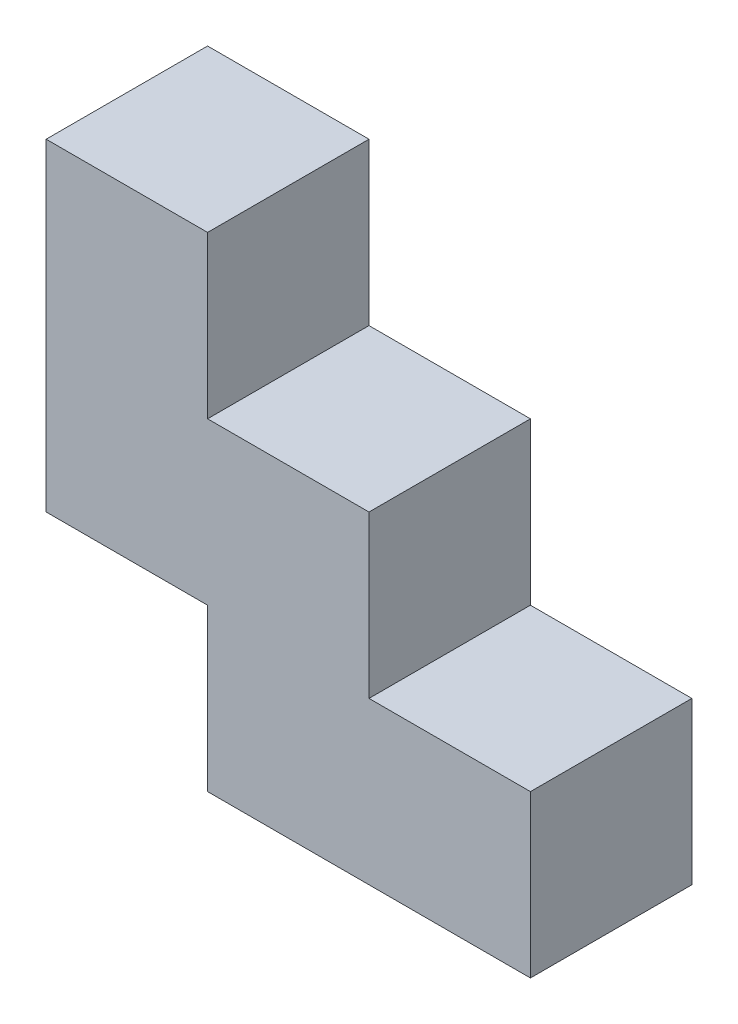
ISO-10303-21;
HEADER;
FILE_DESCRIPTION(('STEP AP214'),'2;1');
FILE_NAME('part.step','',(''),(''),'','','');
FILE_SCHEMA(('AUTOMOTIVE_DESIGN { 1 0 10303 214 1 1 1 1 }'));
ENDSEC;
DATA;
#1=APPLICATION_CONTEXT('core data for automotive mechanical design processes');
#2=APPLICATION_PROTOCOL_DEFINITION('international standard','automotive_design',2000,#1);
#3=PRODUCT_CONTEXT('',#1,'mechanical');
#4=PRODUCT('Part','Part','',(#3));
#5=PRODUCT_RELATED_PRODUCT_CATEGORY('part','',(#4));
#6=PRODUCT_DEFINITION_FORMATION('','',#4);
#7=PRODUCT_DEFINITION_CONTEXT('part definition',#1,'design');
#8=PRODUCT_DEFINITION('design','',#6,#7);
#9=PRODUCT_DEFINITION_SHAPE('','',#8);
#10=(LENGTH_UNIT() NAMED_UNIT(*) SI_UNIT(.MILLI.,.METRE.));
#11=(NAMED_UNIT(*) PLANE_ANGLE_UNIT() SI_UNIT($,.RADIAN.));
#12=(NAMED_UNIT(*) SI_UNIT($,.STERADIAN.) SOLID_ANGLE_UNIT());
#13=UNCERTAINTY_MEASURE_WITH_UNIT(LENGTH_MEASURE(1.E-05),#10,'distance_accuracy_value','');
#14=(GEOMETRIC_REPRESENTATION_CONTEXT(3) GLOBAL_UNCERTAINTY_ASSIGNED_CONTEXT((#13)) GLOBAL_UNIT_ASSIGNED_CONTEXT((#10,
#11,#12)) REPRESENTATION_CONTEXT('',''));
#15=CARTESIAN_POINT('',(0.,0.,0.));
#16=DIRECTION('',(0.,0.,1.));
#17=DIRECTION('',(1.,0.,0.));
#18=AXIS2_PLACEMENT_3D('',#15,#16,#17);
#19=CARTESIAN_POINT('',(76.2,0.,25.4));
#20=DIRECTION('',(-1.,0.,0.));
#21=DIRECTION('',(0.,0.,1.));
#22=AXIS2_PLACEMENT_3D('',#19,#20,#21);
#23=PLANE('',#22);
#24=DIRECTION('',(0.,1.,0.));
#25=VECTOR('',#24,1.);
#26=CARTESIAN_POINT('',(76.2,0.,0.));
#27=LINE('',#26,#25);
#28=CARTESIAN_POINT('',(76.2,0.,0.));
#29=VERTEX_POINT('',#28);
#30=CARTESIAN_POINT('',(76.2,25.4,0.));
#31=VERTEX_POINT('',#30);
#32=EDGE_CURVE('E145',#29,#31,#27,.T.);
#33=ORIENTED_EDGE('',*,*,#32,.T.);
#34=DIRECTION('',(0.,0.,-1.));
#35=VECTOR('',#34,1.);
#36=CARTESIAN_POINT('',(76.2,25.4,25.4));
#37=LINE('',#36,#35);
#38=CARTESIAN_POINT('',(76.2,25.4,25.4));
#39=VERTEX_POINT('',#38);
#40=EDGE_CURVE('E41',#39,#31,#37,.T.);
#41=ORIENTED_EDGE('',*,*,#40,.F.);
#42=DIRECTION('',(0.,1.,0.));
#43=VECTOR('',#42,1.);
#44=CARTESIAN_POINT('',(76.2,0.,25.4));
#45=LINE('',#44,#43);
#46=CARTESIAN_POINT('',(76.2,0.,25.4));
#47=VERTEX_POINT('',#46);
#48=EDGE_CURVE('E99',#47,#39,#45,.T.);
#49=ORIENTED_EDGE('',*,*,#48,.F.);
#50=DIRECTION('',(0.,0.,-1.));
#51=VECTOR('',#50,1.);
#52=CARTESIAN_POINT('',(76.2,0.,25.4));
#53=LINE('',#52,#51);
#54=EDGE_CURVE('E11',#47,#29,#53,.T.);
#55=ORIENTED_EDGE('',*,*,#54,.T.);
#56=EDGE_LOOP('',(#33,#41,#49,#55));
#57=FACE_BOUND('',#56,.T.);
#58=ADVANCED_FACE('F33',(#57),#23,.F.);
#59=CARTESIAN_POINT('',(76.2,25.4,25.4));
#60=DIRECTION('',(0.,-1.,0.));
#61=DIRECTION('',(0.,0.,-1.));
#62=AXIS2_PLACEMENT_3D('',#59,#60,#61);
#63=PLANE('',#62);
#64=DIRECTION('',(-1.,0.,0.));
#65=VECTOR('',#64,1.);
#66=CARTESIAN_POINT('',(76.2,25.4,0.));
#67=LINE('',#66,#65);
#68=CARTESIAN_POINT('',(50.8,25.4,0.));
#69=VERTEX_POINT('',#68);
#70=EDGE_CURVE('E147',#31,#69,#67,.T.);
#71=ORIENTED_EDGE('',*,*,#70,.T.);
#72=DIRECTION('',(0.,0.,-1.));
#73=VECTOR('',#72,1.);
#74=CARTESIAN_POINT('',(50.8,25.4,25.4));
#75=LINE('',#74,#73);
#76=CARTESIAN_POINT('',(50.8,25.4,25.4));
#77=VERTEX_POINT('',#76);
#78=EDGE_CURVE('E174',#77,#69,#75,.T.);
#79=ORIENTED_EDGE('',*,*,#78,.F.);
#80=DIRECTION('',(-1.,0.,0.));
#81=VECTOR('',#80,1.);
#82=CARTESIAN_POINT('',(76.2,25.4,25.4));
#83=LINE('',#82,#81);
#84=EDGE_CURVE('E182',#39,#77,#83,.T.);
#85=ORIENTED_EDGE('',*,*,#84,.F.);
#86=ORIENTED_EDGE('',*,*,#40,.T.);
#87=EDGE_LOOP('',(#71,#79,#85,#86));
#88=FACE_BOUND('',#87,.T.);
#89=ADVANCED_FACE('F180',(#88),#63,.F.);
#90=CARTESIAN_POINT('',(50.8,25.4,25.4));
#91=DIRECTION('',(-1.,0.,0.));
#92=DIRECTION('',(0.,0.,1.));
#93=AXIS2_PLACEMENT_3D('',#90,#91,#92);
#94=PLANE('',#93);
#95=DIRECTION('',(0.,1.,0.));
#96=VECTOR('',#95,1.);
#97=CARTESIAN_POINT('',(50.8,25.4,0.));
#98=LINE('',#97,#96);
#99=CARTESIAN_POINT('',(50.8,50.8,0.));
#100=VERTEX_POINT('',#99);
#101=EDGE_CURVE('E149',#69,#100,#98,.T.);
#102=ORIENTED_EDGE('',*,*,#101,.T.);
#103=DIRECTION('',(0.,0.,-1.));
#104=VECTOR('',#103,1.);
#105=CARTESIAN_POINT('',(50.8,50.8,25.4));
#106=LINE('',#105,#104);
#107=CARTESIAN_POINT('',(50.8,50.8,25.4));
#108=VERTEX_POINT('',#107);
#109=EDGE_CURVE('E171',#108,#100,#106,.T.);
#110=ORIENTED_EDGE('',*,*,#109,.F.);
#111=DIRECTION('',(0.,1.,0.));
#112=VECTOR('',#111,1.);
#113=CARTESIAN_POINT('',(50.8,25.4,25.4));
#114=LINE('',#113,#112);
#115=EDGE_CURVE('E201',#77,#108,#114,.T.);
#116=ORIENTED_EDGE('',*,*,#115,.F.);
#117=ORIENTED_EDGE('',*,*,#78,.T.);
#118=EDGE_LOOP('',(#102,#110,#116,#117));
#119=FACE_BOUND('',#118,.T.);
#120=ADVANCED_FACE('F192',(#119),#94,.F.);
#121=CARTESIAN_POINT('',(50.8,50.8,25.4));
#122=DIRECTION('',(0.,-1.,0.));
#123=DIRECTION('',(0.,0.,-1.));
#124=AXIS2_PLACEMENT_3D('',#121,#122,#123);
#125=PLANE('',#124);
#126=DIRECTION('',(-1.,0.,0.));
#127=VECTOR('',#126,1.);
#128=CARTESIAN_POINT('',(50.8,50.8,0.));
#129=LINE('',#128,#127);
#130=CARTESIAN_POINT('',(25.4,50.8,0.));
#131=VERTEX_POINT('',#130);
#132=EDGE_CURVE('E151',#100,#131,#129,.T.);
#133=ORIENTED_EDGE('',*,*,#132,.T.);
#134=DIRECTION('',(0.,0.,-1.));
#135=VECTOR('',#134,1.);
#136=CARTESIAN_POINT('',(25.4,50.8,25.4));
#137=LINE('',#136,#135);
#138=CARTESIAN_POINT('',(25.4,50.8,25.4));
#139=VERTEX_POINT('',#138);
#140=EDGE_CURVE('E168',#139,#131,#137,.T.);
#141=ORIENTED_EDGE('',*,*,#140,.F.);
#142=DIRECTION('',(-1.,0.,0.));
#143=VECTOR('',#142,1.);
#144=CARTESIAN_POINT('',(50.8,50.8,25.4));
#145=LINE('',#144,#143);
#146=EDGE_CURVE('E198',#108,#139,#145,.T.);
#147=ORIENTED_EDGE('',*,*,#146,.F.);
#148=ORIENTED_EDGE('',*,*,#109,.T.);
#149=EDGE_LOOP('',(#133,#141,#147,#148));
#150=FACE_BOUND('',#149,.T.);
#151=ADVANCED_FACE('F196',(#150),#125,.F.);
#152=CARTESIAN_POINT('',(25.4,50.8,25.4));
#153=DIRECTION('',(-1.,0.,0.));
#154=DIRECTION('',(0.,0.,1.));
#155=AXIS2_PLACEMENT_3D('',#152,#153,#154);
#156=PLANE('',#155);
#157=DIRECTION('',(0.,1.,0.));
#158=VECTOR('',#157,1.);
#159=CARTESIAN_POINT('',(25.4,50.8,0.));
#160=LINE('',#159,#158);
#161=CARTESIAN_POINT('',(25.4,76.2,0.));
#162=VERTEX_POINT('',#161);
#163=EDGE_CURVE('E153',#131,#162,#160,.T.);
#164=ORIENTED_EDGE('',*,*,#163,.T.);
#165=DIRECTION('',(0.,0.,-1.));
#166=VECTOR('',#165,1.);
#167=CARTESIAN_POINT('',(25.4,76.2,25.4));
#168=LINE('',#167,#166);
#169=CARTESIAN_POINT('',(25.4,76.2,25.4));
#170=VERTEX_POINT('',#169);
#171=EDGE_CURVE('E165',#170,#162,#168,.T.);
#172=ORIENTED_EDGE('',*,*,#171,.F.);
#173=DIRECTION('',(0.,1.,0.));
#174=VECTOR('',#173,1.);
#175=CARTESIAN_POINT('',(25.4,50.8,25.4));
#176=LINE('',#175,#174);
#177=EDGE_CURVE('E200',#139,#170,#176,.T.);
#178=ORIENTED_EDGE('',*,*,#177,.F.);
#179=ORIENTED_EDGE('',*,*,#140,.T.);
#180=EDGE_LOOP('',(#164,#172,#178,#179));
#181=FACE_BOUND('',#180,.T.);
#182=ADVANCED_FACE('F220',(#181),#156,.F.);
#183=CARTESIAN_POINT('',(25.4,76.2,25.4));
#184=DIRECTION('',(0.,-1.,0.));
#185=DIRECTION('',(0.,0.,-1.));
#186=AXIS2_PLACEMENT_3D('',#183,#184,#185);
#187=PLANE('',#186);
#188=DIRECTION('',(-1.,0.,0.));
#189=VECTOR('',#188,1.);
#190=CARTESIAN_POINT('',(25.4,76.2,0.));
#191=LINE('',#190,#189);
#192=CARTESIAN_POINT('',(0.,76.2,0.));
#193=VERTEX_POINT('',#192);
#194=EDGE_CURVE('E155',#162,#193,#191,.T.);
#195=ORIENTED_EDGE('',*,*,#194,.T.);
#196=DIRECTION('',(0.,0.,-1.));
#197=VECTOR('',#196,1.);
#198=CARTESIAN_POINT('',(0.,76.2,25.4));
#199=LINE('',#198,#197);
#200=CARTESIAN_POINT('',(0.,76.2,25.4));
#201=VERTEX_POINT('',#200);
#202=EDGE_CURVE('E134',#201,#193,#199,.T.);
#203=ORIENTED_EDGE('',*,*,#202,.F.);
#204=DIRECTION('',(-1.,0.,0.));
#205=VECTOR('',#204,1.);
#206=CARTESIAN_POINT('',(25.4,76.2,25.4));
#207=LINE('',#206,#205);
#208=EDGE_CURVE('E125',#170,#201,#207,.T.);
#209=ORIENTED_EDGE('',*,*,#208,.F.);
#210=ORIENTED_EDGE('',*,*,#171,.T.);
#211=EDGE_LOOP('',(#195,#203,#209,#210));
#212=FACE_BOUND('',#211,.T.);
#213=ADVANCED_FACE('F223',(#212),#187,.F.);
#214=CARTESIAN_POINT('',(0.,76.2,25.4));
#215=DIRECTION('',(1.,0.,0.));
#216=DIRECTION('',(0.,0.,-1.));
#217=AXIS2_PLACEMENT_3D('',#214,#215,#216);
#218=PLANE('',#217);
#219=DIRECTION('',(0.,-1.,0.));
#220=VECTOR('',#219,1.);
#221=CARTESIAN_POINT('',(0.,76.2,0.));
#222=LINE('',#221,#220);
#223=CARTESIAN_POINT('',(0.,25.4,0.));
#224=VERTEX_POINT('',#223);
#225=EDGE_CURVE('E133',#193,#224,#222,.T.);
#226=ORIENTED_EDGE('',*,*,#225,.T.);
#227=DIRECTION('',(0.,0.,-1.));
#228=VECTOR('',#227,1.);
#229=CARTESIAN_POINT('',(0.,25.4,25.4));
#230=LINE('',#229,#228);
#231=CARTESIAN_POINT('',(0.,25.4,25.4));
#232=VERTEX_POINT('',#231);
#233=EDGE_CURVE('E130',#232,#224,#230,.T.);
#234=ORIENTED_EDGE('',*,*,#233,.F.);
#235=DIRECTION('',(0.,-1.,0.));
#236=VECTOR('',#235,1.);
#237=CARTESIAN_POINT('',(0.,76.2,25.4));
#238=LINE('',#237,#236);
#239=EDGE_CURVE('E119',#201,#232,#238,.T.);
#240=ORIENTED_EDGE('',*,*,#239,.F.);
#241=ORIENTED_EDGE('',*,*,#202,.T.);
#242=EDGE_LOOP('',(#226,#234,#240,#241));
#243=FACE_BOUND('',#242,.T.);
#244=ADVANCED_FACE('F131',(#243),#218,.F.);
#245=CARTESIAN_POINT('',(0.,25.4,25.4));
#246=DIRECTION('',(0.,1.,0.));
#247=DIRECTION('',(0.,0.,1.));
#248=AXIS2_PLACEMENT_3D('',#245,#246,#247);
#249=PLANE('',#248);
#250=DIRECTION('',(1.,0.,0.));
#251=VECTOR('',#250,1.);
#252=CARTESIAN_POINT('',(0.,25.4,0.));
#253=LINE('',#252,#251);
#254=CARTESIAN_POINT('',(25.4,25.4,0.));
#255=VERTEX_POINT('',#254);
#256=EDGE_CURVE('E85',#224,#255,#253,.T.);
#257=ORIENTED_EDGE('',*,*,#256,.T.);
#258=DIRECTION('',(0.,0.,-1.));
#259=VECTOR('',#258,1.);
#260=CARTESIAN_POINT('',(25.4,25.4,25.4));
#261=LINE('',#260,#259);
#262=CARTESIAN_POINT('',(25.4,25.4,25.4));
#263=VERTEX_POINT('',#262);
#264=EDGE_CURVE('E135',#263,#255,#261,.T.);
#265=ORIENTED_EDGE('',*,*,#264,.F.);
#266=DIRECTION('',(1.,0.,0.));
#267=VECTOR('',#266,1.);
#268=CARTESIAN_POINT('',(0.,25.4,25.4));
#269=LINE('',#268,#267);
#270=EDGE_CURVE('E123',#232,#263,#269,.T.);
#271=ORIENTED_EDGE('',*,*,#270,.F.);
#272=ORIENTED_EDGE('',*,*,#233,.T.);
#273=EDGE_LOOP('',(#257,#265,#271,#272));
#274=FACE_BOUND('',#273,.T.);
#275=ADVANCED_FACE('F137',(#274),#249,.F.);
#276=CARTESIAN_POINT('',(25.4,25.4,25.4));
#277=DIRECTION('',(1.,0.,0.));
#278=DIRECTION('',(0.,0.,-1.));
#279=AXIS2_PLACEMENT_3D('',#276,#277,#278);
#280=PLANE('',#279);
#281=DIRECTION('',(0.,-1.,0.));
#282=VECTOR('',#281,1.);
#283=CARTESIAN_POINT('',(25.4,25.4,0.));
#284=LINE('',#283,#282);
#285=CARTESIAN_POINT('',(25.4,0.,0.));
#286=VERTEX_POINT('',#285);
#287=EDGE_CURVE('E92',#255,#286,#284,.T.);
#288=ORIENTED_EDGE('',*,*,#287,.T.);
#289=DIRECTION('',(0.,0.,-1.));
#290=VECTOR('',#289,1.);
#291=CARTESIAN_POINT('',(25.4,0.,25.4));
#292=LINE('',#291,#290);
#293=CARTESIAN_POINT('',(25.4,0.,25.4));
#294=VERTEX_POINT('',#293);
#295=EDGE_CURVE('E141',#294,#286,#292,.T.);
#296=ORIENTED_EDGE('',*,*,#295,.F.);
#297=DIRECTION('',(0.,-1.,0.));
#298=VECTOR('',#297,1.);
#299=CARTESIAN_POINT('',(25.4,25.4,25.4));
#300=LINE('',#299,#298);
#301=EDGE_CURVE('E139',#263,#294,#300,.T.);
#302=ORIENTED_EDGE('',*,*,#301,.F.);
#303=ORIENTED_EDGE('',*,*,#264,.T.);
#304=EDGE_LOOP('',(#288,#296,#302,#303));
#305=FACE_BOUND('',#304,.T.);
#306=ADVANCED_FACE('F232',(#305),#280,.F.);
#307=CARTESIAN_POINT('',(25.4,0.,25.4));
#308=DIRECTION('',(0.,1.,0.));
#309=DIRECTION('',(0.,0.,1.));
#310=AXIS2_PLACEMENT_3D('',#307,#308,#309);
#311=PLANE('',#310);
#312=DIRECTION('',(1.,0.,0.));
#313=VECTOR('',#312,1.);
#314=CARTESIAN_POINT('',(25.4,0.,0.));
#315=LINE('',#314,#313);
#316=EDGE_CURVE('E160',#286,#29,#315,.T.);
#317=ORIENTED_EDGE('',*,*,#316,.T.);
#318=ORIENTED_EDGE('',*,*,#54,.F.);
#319=DIRECTION('',(1.,0.,0.));
#320=VECTOR('',#319,1.);
#321=CARTESIAN_POINT('',(50.8,0.,25.4));
#322=LINE('',#321,#320);
#323=EDGE_CURVE('E49',#294,#47,#322,.T.);
#324=ORIENTED_EDGE('',*,*,#323,.F.);
#325=ORIENTED_EDGE('',*,*,#295,.T.);
#326=EDGE_LOOP('',(#317,#318,#324,#325));
#327=FACE_BOUND('',#326,.T.);
#328=ADVANCED_FACE('F208',(#327),#311,.F.);
#329=CARTESIAN_POINT('',(0.,0.,25.4));
#330=DIRECTION('',(0.,0.,1.));
#331=DIRECTION('',(1.,0.,0.));
#332=AXIS2_PLACEMENT_3D('',#329,#330,#331);
#333=PLANE('',#332);
#334=ORIENTED_EDGE('',*,*,#323,.T.);
#335=ORIENTED_EDGE('',*,*,#48,.T.);
#336=ORIENTED_EDGE('',*,*,#84,.T.);
#337=ORIENTED_EDGE('',*,*,#115,.T.);
#338=ORIENTED_EDGE('',*,*,#146,.T.);
#339=ORIENTED_EDGE('',*,*,#177,.T.);
#340=ORIENTED_EDGE('',*,*,#208,.T.);
#341=ORIENTED_EDGE('',*,*,#239,.T.);
#342=ORIENTED_EDGE('',*,*,#270,.T.);
#343=ORIENTED_EDGE('',*,*,#301,.T.);
#344=EDGE_LOOP('',(#334,#335,#336,#337,#338,#339,#340,#341,#342,#343));
#345=FACE_BOUND('',#344,.T.);
#346=ADVANCED_FACE('F121',(#345),#333,.T.);
#347=CARTESIAN_POINT('',(0.,0.,0.));
#348=DIRECTION('',(0.,0.,1.));
#349=DIRECTION('',(1.,0.,0.));
#350=AXIS2_PLACEMENT_3D('',#347,#348,#349);
#351=PLANE('',#350);
#352=ORIENTED_EDGE('',*,*,#32,.F.);
#353=ORIENTED_EDGE('',*,*,#316,.F.);
#354=ORIENTED_EDGE('',*,*,#287,.F.);
#355=ORIENTED_EDGE('',*,*,#256,.F.);
#356=ORIENTED_EDGE('',*,*,#225,.F.);
#357=ORIENTED_EDGE('',*,*,#194,.F.);
#358=ORIENTED_EDGE('',*,*,#163,.F.);
#359=ORIENTED_EDGE('',*,*,#132,.F.);
#360=ORIENTED_EDGE('',*,*,#101,.F.);
#361=ORIENTED_EDGE('',*,*,#70,.F.);
#362=EDGE_LOOP('',(#352,#353,#354,#355,#356,#357,#358,#359,#360,#361));
#363=FACE_BOUND('',#362,.T.);
#364=ADVANCED_FACE('F186',(#363),#351,.F.);
#365=CLOSED_SHELL('',(#58,#89,#120,#151,#182,#213,#244,#275,#306,#328,#346,#364));
#366=MANIFOLD_SOLID_BREP('B2',#365);
#367=ADVANCED_BREP_SHAPE_REPRESENTATION('',(#18,#366),#14);
#368=SHAPE_DEFINITION_REPRESENTATION(#9,#367);
ENDSEC;
END-ISO-10303-21;
